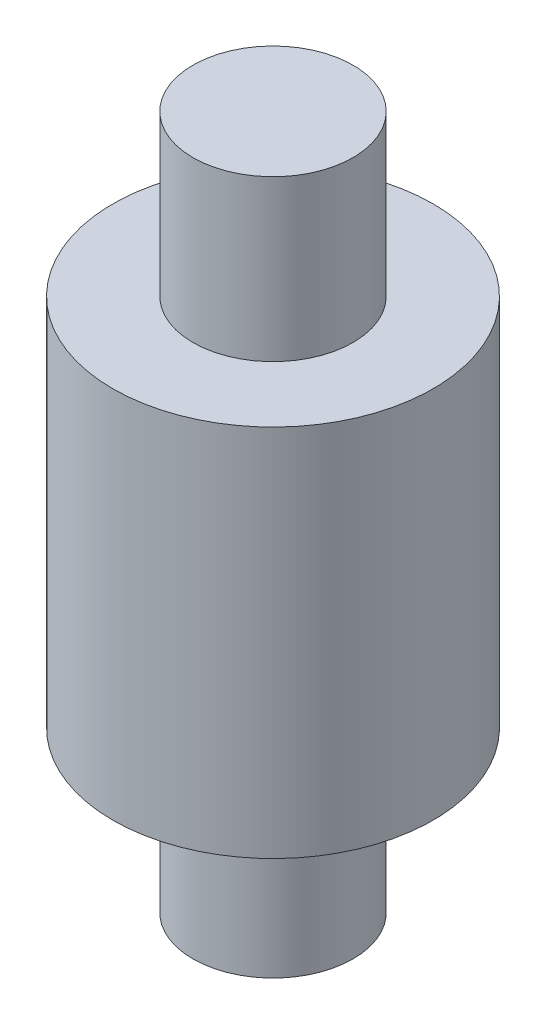
ISO-10303-21;
HEADER;
FILE_DESCRIPTION(('STEP AP214'),'2;1');
FILE_NAME('part.step','',(''),(''),'','','');
FILE_SCHEMA(('AUTOMOTIVE_DESIGN { 1 0 10303 214 1 1 1 1 }'));
ENDSEC;
DATA;
#1=APPLICATION_CONTEXT('core data for automotive mechanical design processes');
#2=APPLICATION_PROTOCOL_DEFINITION('international standard','automotive_design',2000,#1);
#3=PRODUCT_CONTEXT('',#1,'mechanical');
#4=PRODUCT('Part','Part','',(#3));
#5=PRODUCT_RELATED_PRODUCT_CATEGORY('part','',(#4));
#6=PRODUCT_DEFINITION_FORMATION('','',#4);
#7=PRODUCT_DEFINITION_CONTEXT('part definition',#1,'design');
#8=PRODUCT_DEFINITION('design','',#6,#7);
#9=PRODUCT_DEFINITION_SHAPE('','',#8);
#10=(LENGTH_UNIT() NAMED_UNIT(*) SI_UNIT(.MILLI.,.METRE.));
#11=(NAMED_UNIT(*) PLANE_ANGLE_UNIT() SI_UNIT($,.RADIAN.));
#12=(NAMED_UNIT(*) SI_UNIT($,.STERADIAN.) SOLID_ANGLE_UNIT());
#13=UNCERTAINTY_MEASURE_WITH_UNIT(LENGTH_MEASURE(1.E-05),#10,'distance_accuracy_value','');
#14=(GEOMETRIC_REPRESENTATION_CONTEXT(3) GLOBAL_UNCERTAINTY_ASSIGNED_CONTEXT((#13)) GLOBAL_UNIT_ASSIGNED_CONTEXT((#10,
#11,#12)) REPRESENTATION_CONTEXT('',''));
#15=CARTESIAN_POINT('',(0.,0.,0.));
#16=DIRECTION('',(0.,0.,1.));
#17=DIRECTION('',(1.,0.,0.));
#18=AXIS2_PLACEMENT_3D('',#15,#16,#17);
#19=CARTESIAN_POINT('',(0.,7.,0.));
#20=DIRECTION('',(0.,-1.,0.));
#21=DIRECTION('',(0.,0.,-1.));
#22=AXIS2_PLACEMENT_3D('',#19,#20,#21);
#23=CYLINDRICAL_SURFACE('',#22,3.);
#24=CARTESIAN_POINT('',(0.,7.,0.));
#25=DIRECTION('',(0.,1.,0.));
#26=DIRECTION('',(0.,0.,1.));
#27=AXIS2_PLACEMENT_3D('',#24,#25,#26);
#28=CIRCLE('',#27,3.);
#29=CARTESIAN_POINT('',(0.,7.,3.));
#30=VERTEX_POINT('',#29);
#31=EDGE_CURVE('E38',#30,#30,#28,.T.);
#32=ORIENTED_EDGE('',*,*,#31,.F.);
#33=EDGE_LOOP('',(#32));
#34=FACE_BOUND('',#33,.T.);
#35=CARTESIAN_POINT('',(0.,0.,0.));
#36=DIRECTION('',(0.,1.,0.));
#37=DIRECTION('',(0.,0.,1.));
#38=AXIS2_PLACEMENT_3D('',#35,#36,#37);
#39=CIRCLE('',#38,3.);
#40=CARTESIAN_POINT('',(0.,0.,3.));
#41=VERTEX_POINT('',#40);
#42=EDGE_CURVE('E42',#41,#41,#39,.T.);
#43=ORIENTED_EDGE('',*,*,#42,.T.);
#44=EDGE_LOOP('',(#43));
#45=FACE_BOUND('',#44,.T.);
#46=ADVANCED_FACE('F32',(#34,#45),#23,.T.);
#47=CARTESIAN_POINT('',(0.,7.,0.));
#48=DIRECTION('',(0.,1.,0.));
#49=DIRECTION('',(0.,0.,1.));
#50=AXIS2_PLACEMENT_3D('',#47,#48,#49);
#51=PLANE('',#50);
#52=CARTESIAN_POINT('',(0.,7.,0.));
#53=DIRECTION('',(0.,1.,0.));
#54=DIRECTION('',(0.,0.,1.));
#55=AXIS2_PLACEMENT_3D('',#52,#53,#54);
#56=CIRCLE('',#55,1.5);
#57=CARTESIAN_POINT('',(0.,7.,1.5));
#58=VERTEX_POINT('',#57);
#59=EDGE_CURVE('E52',#58,#58,#56,.T.);
#60=ORIENTED_EDGE('',*,*,#59,.F.);
#61=EDGE_LOOP('',(#60));
#62=FACE_BOUND('',#61,.T.);
#63=ORIENTED_EDGE('',*,*,#31,.T.);
#64=EDGE_LOOP('',(#63));
#65=FACE_BOUND('',#64,.T.);
#66=ADVANCED_FACE('F67',(#62,#65),#51,.T.);
#67=CARTESIAN_POINT('',(0.,0.,0.));
#68=DIRECTION('',(0.,1.,0.));
#69=DIRECTION('',(0.,0.,1.));
#70=AXIS2_PLACEMENT_3D('',#67,#68,#69);
#71=PLANE('',#70);
#72=CARTESIAN_POINT('',(0.,0.,0.));
#73=DIRECTION('',(0.,1.,0.));
#74=DIRECTION('',(0.,0.,1.));
#75=AXIS2_PLACEMENT_3D('',#72,#73,#74);
#76=CIRCLE('',#75,1.5);
#77=CARTESIAN_POINT('',(0.,0.,1.5));
#78=VERTEX_POINT('',#77);
#79=EDGE_CURVE('E10',#78,#78,#76,.F.);
#80=ORIENTED_EDGE('',*,*,#79,.F.);
#81=EDGE_LOOP('',(#80));
#82=FACE_BOUND('',#81,.T.);
#83=ORIENTED_EDGE('',*,*,#42,.F.);
#84=EDGE_LOOP('',(#83));
#85=FACE_BOUND('',#84,.T.);
#86=ADVANCED_FACE('F69',(#82,#85),#71,.F.);
#87=CARTESIAN_POINT('',(0.,-3.,0.));
#88=DIRECTION('',(0.,1.,0.));
#89=DIRECTION('',(0.,0.,1.));
#90=AXIS2_PLACEMENT_3D('',#87,#88,#89);
#91=CYLINDRICAL_SURFACE('',#90,1.5);
#92=CARTESIAN_POINT('',(0.,-3.,0.));
#93=DIRECTION('',(0.,-1.,0.));
#94=DIRECTION('',(0.,0.,-1.));
#95=AXIS2_PLACEMENT_3D('',#92,#93,#94);
#96=CIRCLE('',#95,1.5);
#97=CARTESIAN_POINT('',(0.,-3.,-1.5));
#98=VERTEX_POINT('',#97);
#99=EDGE_CURVE('E47',#98,#98,#96,.T.);
#100=ORIENTED_EDGE('',*,*,#99,.F.);
#101=EDGE_LOOP('',(#100));
#102=FACE_BOUND('',#101,.T.);
#103=ORIENTED_EDGE('',*,*,#79,.T.);
#104=EDGE_LOOP('',(#103));
#105=FACE_BOUND('',#104,.T.);
#106=ADVANCED_FACE('F75',(#102,#105),#91,.T.);
#107=CARTESIAN_POINT('',(0.,-3.,0.));
#108=DIRECTION('',(0.,-1.,0.));
#109=DIRECTION('',(0.,0.,-1.));
#110=AXIS2_PLACEMENT_3D('',#107,#108,#109);
#111=PLANE('',#110);
#112=ORIENTED_EDGE('',*,*,#99,.T.);
#113=EDGE_LOOP('',(#112));
#114=FACE_BOUND('',#113,.T.);
#115=ADVANCED_FACE('F63',(#114),#111,.T.);
#116=CARTESIAN_POINT('',(0.,10.,0.));
#117=DIRECTION('',(0.,-1.,0.));
#118=DIRECTION('',(0.,0.,-1.));
#119=AXIS2_PLACEMENT_3D('',#116,#117,#118);
#120=CYLINDRICAL_SURFACE('',#119,1.5);
#121=CARTESIAN_POINT('',(0.,10.,0.));
#122=DIRECTION('',(0.,1.,0.));
#123=DIRECTION('',(0.,0.,1.));
#124=AXIS2_PLACEMENT_3D('',#121,#122,#123);
#125=CIRCLE('',#124,1.5);
#126=CARTESIAN_POINT('',(0.,10.,1.5));
#127=VERTEX_POINT('',#126);
#128=EDGE_CURVE('E51',#127,#127,#125,.T.);
#129=ORIENTED_EDGE('',*,*,#128,.F.);
#130=EDGE_LOOP('',(#129));
#131=FACE_BOUND('',#130,.T.);
#132=ORIENTED_EDGE('',*,*,#59,.T.);
#133=EDGE_LOOP('',(#132));
#134=FACE_BOUND('',#133,.T.);
#135=ADVANCED_FACE('F60',(#131,#134),#120,.T.);
#136=CARTESIAN_POINT('',(0.,10.,0.));
#137=DIRECTION('',(0.,1.,0.));
#138=DIRECTION('',(0.,0.,1.));
#139=AXIS2_PLACEMENT_3D('',#136,#137,#138);
#140=PLANE('',#139);
#141=ORIENTED_EDGE('',*,*,#128,.T.);
#142=EDGE_LOOP('',(#141));
#143=FACE_BOUND('',#142,.T.);
#144=ADVANCED_FACE('F58',(#143),#140,.T.);
#145=CLOSED_SHELL('',(#46,#66,#86,#106,#115,#135,#144));
#146=MANIFOLD_SOLID_BREP('B2',#145);
#147=ADVANCED_BREP_SHAPE_REPRESENTATION('',(#18,#146),#14);
#148=SHAPE_DEFINITION_REPRESENTATION(#9,#147);
ENDSEC;
END-ISO-10303-21;
